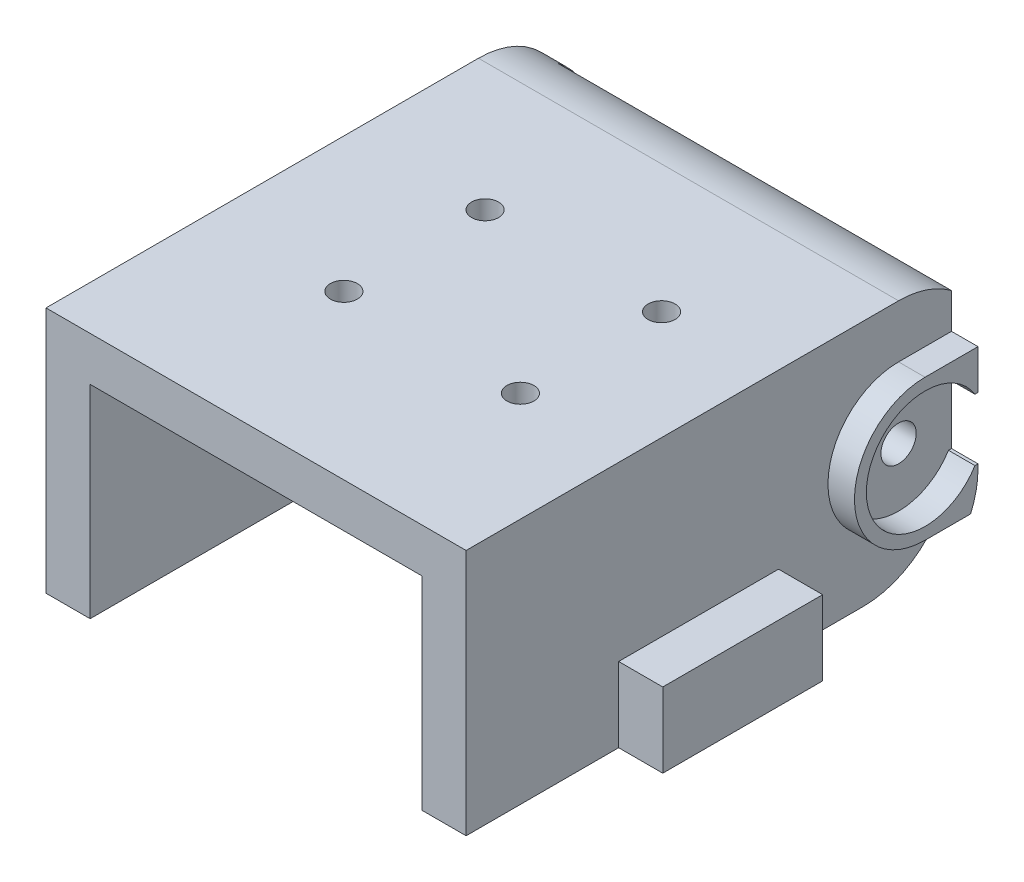
ISO-10303-21;
HEADER;
FILE_DESCRIPTION(('STEP AP214'),'2;1');
FILE_NAME('part.step','',(''),(''),'','','');
FILE_SCHEMA(('AUTOMOTIVE_DESIGN { 1 0 10303 214 1 1 1 1 }'));
ENDSEC;
DATA;
#1=APPLICATION_CONTEXT('core data for automotive mechanical design processes');
#2=APPLICATION_PROTOCOL_DEFINITION('international standard','automotive_design',2000,#1);
#3=PRODUCT_CONTEXT('',#1,'mechanical');
#4=PRODUCT('Part','Part','',(#3));
#5=PRODUCT_RELATED_PRODUCT_CATEGORY('part','',(#4));
#6=PRODUCT_DEFINITION_FORMATION('','',#4);
#7=PRODUCT_DEFINITION_CONTEXT('part definition',#1,'design');
#8=PRODUCT_DEFINITION('design','',#6,#7);
#9=PRODUCT_DEFINITION_SHAPE('','',#8);
#10=(LENGTH_UNIT() NAMED_UNIT(*) SI_UNIT(.MILLI.,.METRE.));
#11=(NAMED_UNIT(*) PLANE_ANGLE_UNIT() SI_UNIT($,.RADIAN.));
#12=(NAMED_UNIT(*) SI_UNIT($,.STERADIAN.) SOLID_ANGLE_UNIT());
#13=UNCERTAINTY_MEASURE_WITH_UNIT(LENGTH_MEASURE(1.E-05),#10,'distance_accuracy_value','');
#14=(GEOMETRIC_REPRESENTATION_CONTEXT(3) GLOBAL_UNCERTAINTY_ASSIGNED_CONTEXT((#13)) GLOBAL_UNIT_ASSIGNED_CONTEXT((#10,
#11,#12)) REPRESENTATION_CONTEXT('',''));
#15=CARTESIAN_POINT('',(0.,0.,0.));
#16=DIRECTION('',(0.,0.,1.));
#17=DIRECTION('',(1.,0.,0.));
#18=AXIS2_PLACEMENT_3D('',#15,#16,#17);
#19=CARTESIAN_POINT('',(0.,0.,0.));
#20=DIRECTION('',(0.,0.,1.));
#21=DIRECTION('',(1.,0.,0.));
#22=AXIS2_PLACEMENT_3D('',#19,#20,#21);
#23=PLANE('',#22);
#24=DIRECTION('',(0.,1.,0.));
#25=VECTOR('',#24,1.);
#26=CARTESIAN_POINT('',(26.8,0.,0.));
#27=LINE('',#26,#25);
#28=CARTESIAN_POINT('',(26.8,-4.,0.));
#29=VERTEX_POINT('',#28);
#30=CARTESIAN_POINT('',(26.8,-3.49999999999999,0.));
#31=VERTEX_POINT('',#30);
#32=EDGE_CURVE('E381',#29,#31,#27,.T.);
#33=ORIENTED_EDGE('',*,*,#32,.F.);
#34=DIRECTION('',(1.,0.,0.));
#35=VECTOR('',#34,1.);
#36=CARTESIAN_POINT('',(0.,-4.,0.));
#37=LINE('',#36,#35);
#38=CARTESIAN_POINT('',(-20.8,-4.,0.));
#39=VERTEX_POINT('',#38);
#40=EDGE_CURVE('E554',#29,#39,#37,.F.);
#41=ORIENTED_EDGE('',*,*,#40,.T.);
#42=DIRECTION('',(0.,-1.,0.));
#43=VECTOR('',#42,1.);
#44=CARTESIAN_POINT('',(-20.8,14.,0.));
#45=LINE('',#44,#43);
#46=CARTESIAN_POINT('',(-20.8,12.,0.));
#47=VERTEX_POINT('',#46);
#48=EDGE_CURVE('E316',#47,#39,#45,.T.);
#49=ORIENTED_EDGE('',*,*,#48,.F.);
#50=DIRECTION('',(1.,0.,0.));
#51=VECTOR('',#50,1.);
#52=CARTESIAN_POINT('',(-20.8,12.,0.));
#53=LINE('',#52,#51);
#54=CARTESIAN_POINT('',(23.8,12.,0.));
#55=VERTEX_POINT('',#54);
#56=EDGE_CURVE('E551',#47,#55,#53,.T.);
#57=ORIENTED_EDGE('',*,*,#56,.T.);
#58=DIRECTION('',(0.,1.,0.));
#59=VECTOR('',#58,1.);
#60=CARTESIAN_POINT('',(23.8,14.,0.));
#61=LINE('',#60,#59);
#62=CARTESIAN_POINT('',(23.8,8.00000000000001,0.));
#63=VERTEX_POINT('',#62);
#64=EDGE_CURVE('E500',#63,#55,#61,.T.);
#65=ORIENTED_EDGE('',*,*,#64,.F.);
#66=DIRECTION('',(-1.,0.,0.));
#67=VECTOR('',#66,1.);
#68=CARTESIAN_POINT('',(26.8,8.00000000000001,0.));
#69=LINE('',#68,#67);
#70=CARTESIAN_POINT('',(26.8,8.00000000000001,0.));
#71=VERTEX_POINT('',#70);
#72=EDGE_CURVE('E434',#71,#63,#69,.T.);
#73=ORIENTED_EDGE('',*,*,#72,.F.);
#74=DIRECTION('',(0.,1.,0.));
#75=VECTOR('',#74,1.);
#76=CARTESIAN_POINT('',(26.8,0.,0.));
#77=LINE('',#76,#75);
#78=CARTESIAN_POINT('',(26.8,3.50000000000001,0.));
#79=VERTEX_POINT('',#78);
#80=EDGE_CURVE('E396',#79,#71,#77,.T.);
#81=ORIENTED_EDGE('',*,*,#80,.F.);
#82=DIRECTION('',(-1.,0.,0.));
#83=VECTOR('',#82,1.);
#84=CARTESIAN_POINT('',(26.8,3.50000000000001,0.));
#85=LINE('',#84,#83);
#86=CARTESIAN_POINT('',(23.8,3.50000000000001,0.));
#87=VERTEX_POINT('',#86);
#88=EDGE_CURVE('E438',#79,#87,#85,.T.);
#89=ORIENTED_EDGE('',*,*,#88,.T.);
#90=CARTESIAN_POINT('',(23.8,-3.49999999999999,0.));
#91=VERTEX_POINT('',#90);
#92=EDGE_CURVE('E509',#91,#87,#61,.T.);
#93=ORIENTED_EDGE('',*,*,#92,.F.);
#94=DIRECTION('',(-1.,0.,0.));
#95=VECTOR('',#94,1.);
#96=CARTESIAN_POINT('',(26.8,-3.49999999999999,0.));
#97=LINE('',#96,#95);
#98=EDGE_CURVE('E450',#31,#91,#97,.T.);
#99=ORIENTED_EDGE('',*,*,#98,.F.);
#100=EDGE_LOOP('',(#33,#41,#49,#57,#65,#73,#81,#89,#93,#99));
#101=FACE_BOUND('',#100,.T.);
#102=ADVANCED_FACE('F47',(#101),#23,.F.);
#103=CARTESIAN_POINT('',(23.8,14.,55.));
#104=DIRECTION('',(-1.,0.,0.));
#105=DIRECTION('',(0.,-1.,0.));
#106=AXIS2_PLACEMENT_3D('',#103,#104,#105);
#107=PLANE('',#106);
#108=CARTESIAN_POINT('',(23.8,0.,6.));
#109=DIRECTION('',(1.,0.,0.));
#110=DIRECTION('',(0.,1.,0.));
#111=AXIS2_PLACEMENT_3D('',#108,#109,#110);
#112=CIRCLE('',#111,2.);
#113=CARTESIAN_POINT('',(23.8,2.00000000000001,6.));
#114=VERTEX_POINT('',#113);
#115=EDGE_CURVE('E495',#114,#114,#112,.T.);
#116=ORIENTED_EDGE('',*,*,#115,.F.);
#117=EDGE_LOOP('',(#116));
#118=FACE_BOUND('',#117,.T.);
#119=CARTESIAN_POINT('',(23.8,0.,6.));
#120=DIRECTION('',(1.,0.,0.));
#121=DIRECTION('',(0.,1.,0.));
#122=AXIS2_PLACEMENT_3D('',#119,#120,#121);
#123=CIRCLE('',#122,6.65);
#124=CARTESIAN_POINT('',(23.8,3.50000000000001,0.345576952508767));
#125=VERTEX_POINT('',#124);
#126=CARTESIAN_POINT('',(23.8,-3.49999999999999,0.34557695250877));
#127=VERTEX_POINT('',#126);
#128=EDGE_CURVE('E413',#125,#127,#123,.T.);
#129=ORIENTED_EDGE('',*,*,#128,.T.);
#130=DIRECTION('',(0.,0.,-1.));
#131=VECTOR('',#130,1.);
#132=CARTESIAN_POINT('',(23.8,-3.49999999999999,0.));
#133=LINE('',#132,#131);
#134=EDGE_CURVE('E410',#127,#91,#133,.T.);
#135=ORIENTED_EDGE('',*,*,#134,.T.);
#136=ORIENTED_EDGE('',*,*,#92,.T.);
#137=DIRECTION('',(0.,0.,-1.));
#138=VECTOR('',#137,1.);
#139=CARTESIAN_POINT('',(23.8,3.50000000000001,0.));
#140=LINE('',#139,#138);
#141=EDGE_CURVE('E416',#125,#87,#140,.T.);
#142=ORIENTED_EDGE('',*,*,#141,.F.);
#143=EDGE_LOOP('',(#129,#135,#136,#142));
#144=FACE_BOUND('',#143,.T.);
#145=ADVANCED_FACE('F702',(#118,#144),#107,.F.);
#146=DIRECTION('',(0.,0.,-1.));
#147=VECTOR('',#146,1.);
#148=CARTESIAN_POINT('',(23.8,-14.,55.));
#149=LINE('',#148,#147);
#150=CARTESIAN_POINT('',(23.8,-14.,19.6013578747392));
#151=VERTEX_POINT('',#150);
#152=CARTESIAN_POINT('',(23.8,-14.,10.));
#153=VERTEX_POINT('',#152);
#154=EDGE_CURVE('E519',#151,#153,#149,.T.);
#155=ORIENTED_EDGE('',*,*,#154,.T.);
#156=CARTESIAN_POINT('',(23.8,-4.,10.));
#157=DIRECTION('',(-1.,0.,0.));
#158=DIRECTION('',(0.,-1.,0.));
#159=AXIS2_PLACEMENT_3D('',#156,#157,#158);
#160=CIRCLE('',#159,10.);
#161=CARTESIAN_POINT('',(23.8,-7.99999999999999,0.834848610088319));
#162=VERTEX_POINT('',#161);
#163=EDGE_CURVE('E542',#153,#162,#160,.F.);
#164=ORIENTED_EDGE('',*,*,#163,.T.);
#165=DIRECTION('',(0.,0.,-1.));
#166=VECTOR('',#165,1.);
#167=CARTESIAN_POINT('',(23.8,-7.99999999999999,0.));
#168=LINE('',#167,#166);
#169=CARTESIAN_POINT('',(23.8,-7.99999999999999,6.));
#170=VERTEX_POINT('',#169);
#171=EDGE_CURVE('E376',#170,#162,#168,.T.);
#172=ORIENTED_EDGE('',*,*,#171,.F.);
#173=CARTESIAN_POINT('',(23.8,0.,6.));
#174=DIRECTION('',(1.,0.,0.));
#175=DIRECTION('',(0.,1.,0.));
#176=AXIS2_PLACEMENT_3D('',#173,#174,#175);
#177=CIRCLE('',#176,8.);
#178=CARTESIAN_POINT('',(23.8,8.00000000000001,6.));
#179=VERTEX_POINT('',#178);
#180=EDGE_CURVE('E382',#179,#170,#177,.T.);
#181=ORIENTED_EDGE('',*,*,#180,.F.);
#182=DIRECTION('',(0.,0.,-1.));
#183=VECTOR('',#182,1.);
#184=CARTESIAN_POINT('',(23.8,8.00000000000001,0.));
#185=LINE('',#184,#183);
#186=EDGE_CURVE('E420',#179,#63,#185,.T.);
#187=ORIENTED_EDGE('',*,*,#186,.T.);
#188=ORIENTED_EDGE('',*,*,#64,.T.);
#189=CARTESIAN_POINT('',(23.8,4.,6.));
#190=DIRECTION('',(-1.,0.,0.));
#191=DIRECTION('',(0.,-1.,0.));
#192=AXIS2_PLACEMENT_3D('',#189,#190,#191);
#193=CIRCLE('',#192,10.);
#194=CARTESIAN_POINT('',(23.8,14.,6.));
#195=VERTEX_POINT('',#194);
#196=EDGE_CURVE('E539',#55,#195,#193,.F.);
#197=ORIENTED_EDGE('',*,*,#196,.T.);
#198=DIRECTION('',(0.,0.,-1.));
#199=VECTOR('',#198,1.);
#200=CARTESIAN_POINT('',(23.8,14.,55.));
#201=LINE('',#200,#199);
#202=CARTESIAN_POINT('',(23.8,14.,55.));
#203=VERTEX_POINT('',#202);
#204=EDGE_CURVE('E357',#203,#195,#201,.T.);
#205=ORIENTED_EDGE('',*,*,#204,.F.);
#206=DIRECTION('',(0.,1.,0.));
#207=VECTOR('',#206,1.);
#208=CARTESIAN_POINT('',(23.8,14.,55.));
#209=LINE('',#208,#207);
#210=CARTESIAN_POINT('',(23.8,-14.,55.));
#211=VERTEX_POINT('',#210);
#212=EDGE_CURVE('E504',#211,#203,#209,.T.);
#213=ORIENTED_EDGE('',*,*,#212,.F.);
#214=CARTESIAN_POINT('',(23.8,-14.,37.7174277893702));
#215=VERTEX_POINT('',#214);
#216=EDGE_CURVE('E523',#211,#215,#149,.T.);
#217=ORIENTED_EDGE('',*,*,#216,.T.);
#218=DIRECTION('',(0.,-1.,0.));
#219=VECTOR('',#218,1.);
#220=CARTESIAN_POINT('',(23.8,-14.,37.7174277893702));
#221=LINE('',#220,#219);
#222=CARTESIAN_POINT('',(23.8,-5.53669618417802,37.7174277893702));
#223=VERTEX_POINT('',#222);
#224=EDGE_CURVE('E454',#223,#215,#221,.T.);
#225=ORIENTED_EDGE('',*,*,#224,.F.);
#226=DIRECTION('',(0.,0.,1.));
#227=VECTOR('',#226,1.);
#228=CARTESIAN_POINT('',(23.8,-5.53669618417802,37.7174277893702));
#229=LINE('',#228,#227);
#230=CARTESIAN_POINT('',(23.8,-5.53669618417802,19.6013578747392));
#231=VERTEX_POINT('',#230);
#232=EDGE_CURVE('E460',#231,#223,#229,.T.);
#233=ORIENTED_EDGE('',*,*,#232,.F.);
#234=DIRECTION('',(0.,1.,0.));
#235=VECTOR('',#234,1.);
#236=CARTESIAN_POINT('',(23.8,-14.,19.6013578747392));
#237=LINE('',#236,#235);
#238=EDGE_CURVE('E473',#151,#231,#237,.T.);
#239=ORIENTED_EDGE('',*,*,#238,.F.);
#240=EDGE_LOOP('',(#155,#164,#172,#181,#187,#188,#197,#205,#213,#217,#225,#233,#239));
#241=FACE_BOUND('',#240,.T.);
#242=ADVANCED_FACE('F616',(#241),#107,.F.);
#243=CARTESIAN_POINT('',(-23.8,14.,55.));
#244=DIRECTION('',(0.,-1.,0.));
#245=DIRECTION('',(0.,0.,-1.));
#246=AXIS2_PLACEMENT_3D('',#243,#244,#245);
#247=PLANE('',#246);
#248=CARTESIAN_POINT('',(-8.54999999999984,14.,36.5));
#249=DIRECTION('',(0.,1.,0.));
#250=DIRECTION('',(0.,0.,1.));
#251=AXIS2_PLACEMENT_3D('',#248,#249,#250);
#252=CIRCLE('',#251,1.53015016707913);
#253=CARTESIAN_POINT('',(-8.54999999999984,14.,38.0301501670791));
#254=VERTEX_POINT('',#253);
#255=EDGE_CURVE('E300',#254,#254,#252,.T.);
#256=ORIENTED_EDGE('',*,*,#255,.F.);
#257=EDGE_LOOP('',(#256));
#258=FACE_BOUND('',#257,.T.);
#259=CARTESIAN_POINT('',(11.4500000000002,14.,36.5));
#260=DIRECTION('',(0.,1.,0.));
#261=DIRECTION('',(0.,0.,1.));
#262=AXIS2_PLACEMENT_3D('',#259,#260,#261);
#263=CIRCLE('',#262,1.53015016707913);
#264=CARTESIAN_POINT('',(11.4500000000002,14.,38.0301501670791));
#265=VERTEX_POINT('',#264);
#266=EDGE_CURVE('E306',#265,#265,#263,.T.);
#267=ORIENTED_EDGE('',*,*,#266,.F.);
#268=EDGE_LOOP('',(#267));
#269=FACE_BOUND('',#268,.T.);
#270=CARTESIAN_POINT('',(11.45,14.,20.5));
#271=DIRECTION('',(0.,1.,0.));
#272=DIRECTION('',(0.,0.,1.));
#273=AXIS2_PLACEMENT_3D('',#270,#271,#272);
#274=CIRCLE('',#273,1.53015016707913);
#275=CARTESIAN_POINT('',(11.45,14.,22.0301501670791));
#276=VERTEX_POINT('',#275);
#277=EDGE_CURVE('E301',#276,#276,#274,.T.);
#278=ORIENTED_EDGE('',*,*,#277,.F.);
#279=EDGE_LOOP('',(#278));
#280=FACE_BOUND('',#279,.T.);
#281=CARTESIAN_POINT('',(-8.55,14.,20.5));
#282=DIRECTION('',(0.,1.,0.));
#283=DIRECTION('',(0.,0.,1.));
#284=AXIS2_PLACEMENT_3D('',#281,#282,#283);
#285=CIRCLE('',#284,1.53015016707913);
#286=CARTESIAN_POINT('',(-8.55,14.,22.0301501670791));
#287=VERTEX_POINT('',#286);
#288=EDGE_CURVE('E305',#287,#287,#285,.T.);
#289=ORIENTED_EDGE('',*,*,#288,.F.);
#290=EDGE_LOOP('',(#289));
#291=FACE_BOUND('',#290,.T.);
#292=ORIENTED_EDGE('',*,*,#204,.T.);
#293=DIRECTION('',(1.,0.,0.));
#294=VECTOR('',#293,1.);
#295=CARTESIAN_POINT('',(-23.8,14.,6.));
#296=LINE('',#295,#294);
#297=CARTESIAN_POINT('',(-23.8,14.,6.));
#298=VERTEX_POINT('',#297);
#299=EDGE_CURVE('E564',#195,#298,#296,.F.);
#300=ORIENTED_EDGE('',*,*,#299,.T.);
#301=DIRECTION('',(0.,0.,-1.));
#302=VECTOR('',#301,1.);
#303=CARTESIAN_POINT('',(-23.8,14.,55.));
#304=LINE('',#303,#302);
#305=CARTESIAN_POINT('',(-23.8,14.,55.));
#306=VERTEX_POINT('',#305);
#307=EDGE_CURVE('E529',#306,#298,#304,.T.);
#308=ORIENTED_EDGE('',*,*,#307,.F.);
#309=DIRECTION('',(-1.,0.,0.));
#310=VECTOR('',#309,1.);
#311=CARTESIAN_POINT('',(-23.8,14.,55.));
#312=LINE('',#311,#310);
#313=EDGE_CURVE('E508',#203,#306,#312,.T.);
#314=ORIENTED_EDGE('',*,*,#313,.F.);
#315=EDGE_LOOP('',(#292,#300,#308,#314));
#316=FACE_BOUND('',#315,.T.);
#317=ADVANCED_FACE('F612',(#258,#269,#280,#291,#316),#247,.F.);
#318=CARTESIAN_POINT('',(-23.8,14.,55.));
#319=DIRECTION('',(1.,0.,0.));
#320=DIRECTION('',(0.,1.,0.));
#321=AXIS2_PLACEMENT_3D('',#318,#319,#320);
#322=PLANE('',#321);
#323=DIRECTION('',(0.,1.,0.));
#324=VECTOR('',#323,1.);
#325=CARTESIAN_POINT('',(-23.8,14.,-4.));
#326=LINE('',#325,#324);
#327=CARTESIAN_POINT('',(-23.8,-4.,-4.));
#328=VERTEX_POINT('',#327);
#329=CARTESIAN_POINT('',(-23.8,4.,-4.));
#330=VERTEX_POINT('',#329);
#331=EDGE_CURVE('E317',#328,#330,#326,.T.);
#332=ORIENTED_EDGE('',*,*,#331,.F.);
#333=CARTESIAN_POINT('',(-23.8,-4.,6.));
#334=DIRECTION('',(1.,0.,0.));
#335=DIRECTION('',(0.,1.,0.));
#336=AXIS2_PLACEMENT_3D('',#333,#334,#335);
#337=CIRCLE('',#336,10.);
#338=CARTESIAN_POINT('',(-23.8,-14.,6.));
#339=VERTEX_POINT('',#338);
#340=EDGE_CURVE('E579',#328,#339,#337,.F.);
#341=ORIENTED_EDGE('',*,*,#340,.T.);
#342=DIRECTION('',(0.,0.,-1.));
#343=VECTOR('',#342,1.);
#344=CARTESIAN_POINT('',(-23.8,-14.,55.));
#345=LINE('',#344,#343);
#346=CARTESIAN_POINT('',(-23.8,-14.,55.));
#347=VERTEX_POINT('',#346);
#348=EDGE_CURVE('E526',#347,#339,#345,.T.);
#349=ORIENTED_EDGE('',*,*,#348,.F.);
#350=DIRECTION('',(0.,-1.,0.));
#351=VECTOR('',#350,1.);
#352=CARTESIAN_POINT('',(-23.8,14.,55.));
#353=LINE('',#352,#351);
#354=EDGE_CURVE('E512',#306,#347,#353,.T.);
#355=ORIENTED_EDGE('',*,*,#354,.F.);
#356=ORIENTED_EDGE('',*,*,#307,.T.);
#357=CARTESIAN_POINT('',(-23.8,4.,6.));
#358=DIRECTION('',(1.,0.,0.));
#359=DIRECTION('',(0.,1.,0.));
#360=AXIS2_PLACEMENT_3D('',#357,#358,#359);
#361=CIRCLE('',#360,10.);
#362=EDGE_CURVE('E567',#298,#330,#361,.F.);
#363=ORIENTED_EDGE('',*,*,#362,.T.);
#364=EDGE_LOOP('',(#332,#341,#349,#355,#356,#363));
#365=FACE_BOUND('',#364,.T.);
#366=CARTESIAN_POINT('',(-23.8,0.,6.));
#367=DIRECTION('',(-1.,0.,0.));
#368=DIRECTION('',(0.,-1.,0.));
#369=AXIS2_PLACEMENT_3D('',#366,#367,#368);
#370=CIRCLE('',#369,10.);
#371=CARTESIAN_POINT('',(-23.8,-3.5,-3.36749699759759));
#372=VERTEX_POINT('',#371);
#373=CARTESIAN_POINT('',(-23.8,3.5,-3.36749699759759));
#374=VERTEX_POINT('',#373);
#375=EDGE_CURVE('E351',#372,#374,#370,.T.);
#376=ORIENTED_EDGE('',*,*,#375,.F.);
#377=DIRECTION('',(0.,0.,-1.));
#378=VECTOR('',#377,1.);
#379=CARTESIAN_POINT('',(-23.8,-3.5,0.));
#380=LINE('',#379,#378);
#381=CARTESIAN_POINT('',(-23.8,-3.5,-1.19374728496908));
#382=VERTEX_POINT('',#381);
#383=EDGE_CURVE('E330',#382,#372,#380,.T.);
#384=ORIENTED_EDGE('',*,*,#383,.F.);
#385=CARTESIAN_POINT('',(-23.8,0.,6.));
#386=DIRECTION('',(-1.,0.,0.));
#387=DIRECTION('',(0.,-1.,0.));
#388=AXIS2_PLACEMENT_3D('',#385,#386,#387);
#389=CIRCLE('',#388,8.);
#390=CARTESIAN_POINT('',(-23.8,3.5,-1.19374728496908));
#391=VERTEX_POINT('',#390);
#392=EDGE_CURVE('E347',#382,#391,#389,.T.);
#393=ORIENTED_EDGE('',*,*,#392,.T.);
#394=DIRECTION('',(0.,0.,-1.));
#395=VECTOR('',#394,1.);
#396=CARTESIAN_POINT('',(-23.8,3.5,0.));
#397=LINE('',#396,#395);
#398=EDGE_CURVE('E336',#391,#374,#397,.T.);
#399=ORIENTED_EDGE('',*,*,#398,.T.);
#400=EDGE_LOOP('',(#376,#384,#393,#399));
#401=FACE_BOUND('',#400,.T.);
#402=ADVANCED_FACE('F615',(#365,#401),#322,.F.);
#403=CARTESIAN_POINT('',(-23.8,-14.,55.));
#404=DIRECTION('',(0.,1.,0.));
#405=DIRECTION('',(0.,0.,1.));
#406=AXIS2_PLACEMENT_3D('',#403,#404,#405);
#407=PLANE('',#406);
#408=DIRECTION('',(1.,0.,0.));
#409=VECTOR('',#408,1.);
#410=CARTESIAN_POINT('',(-18.8,-14.,15.));
#411=LINE('',#410,#409);
#412=CARTESIAN_POINT('',(-18.8,-14.,15.));
#413=VERTEX_POINT('',#412);
#414=CARTESIAN_POINT('',(18.8,-14.,15.));
#415=VERTEX_POINT('',#414);
#416=EDGE_CURVE('E257',#413,#415,#411,.T.);
#417=ORIENTED_EDGE('',*,*,#416,.F.);
#418=DIRECTION('',(0.,0.,1.));
#419=VECTOR('',#418,1.);
#420=CARTESIAN_POINT('',(-18.8,-14.,15.));
#421=LINE('',#420,#419);
#422=CARTESIAN_POINT('',(-18.8,-14.,55.));
#423=VERTEX_POINT('',#422);
#424=EDGE_CURVE('E240',#413,#423,#421,.T.);
#425=ORIENTED_EDGE('',*,*,#424,.T.);
#426=DIRECTION('',(1.,0.,0.));
#427=VECTOR('',#426,1.);
#428=CARTESIAN_POINT('',(-23.8,-14.,55.));
#429=LINE('',#428,#427);
#430=EDGE_CURVE('E516',#347,#423,#429,.T.);
#431=ORIENTED_EDGE('',*,*,#430,.F.);
#432=ORIENTED_EDGE('',*,*,#348,.T.);
#433=DIRECTION('',(-1.,0.,0.));
#434=VECTOR('',#433,1.);
#435=CARTESIAN_POINT('',(-23.8,-14.,6.));
#436=LINE('',#435,#434);
#437=CARTESIAN_POINT('',(-20.8,-14.,6.));
#438=VERTEX_POINT('',#437);
#439=EDGE_CURVE('E57',#339,#438,#436,.F.);
#440=ORIENTED_EDGE('',*,*,#439,.T.);
#441=DIRECTION('',(0.,0.,1.));
#442=VECTOR('',#441,1.);
#443=CARTESIAN_POINT('',(-20.8,-14.,-4.));
#444=LINE('',#443,#442);
#445=CARTESIAN_POINT('',(-20.8,-14.,10.));
#446=VERTEX_POINT('',#445);
#447=EDGE_CURVE('E324',#438,#446,#444,.T.);
#448=ORIENTED_EDGE('',*,*,#447,.T.);
#449=DIRECTION('',(1.,0.,0.));
#450=VECTOR('',#449,1.);
#451=CARTESIAN_POINT('',(-23.8,-14.,10.));
#452=LINE('',#451,#450);
#453=EDGE_CURVE('E350',#446,#153,#452,.T.);
#454=ORIENTED_EDGE('',*,*,#453,.T.);
#455=ORIENTED_EDGE('',*,*,#154,.F.);
#456=DIRECTION('',(-1.,0.,0.));
#457=VECTOR('',#456,1.);
#458=CARTESIAN_POINT('',(28.8,-14.,19.6013578747392));
#459=LINE('',#458,#457);
#460=CARTESIAN_POINT('',(28.8,-14.,19.6013578747392));
#461=VERTEX_POINT('',#460);
#462=EDGE_CURVE('E487',#461,#151,#459,.T.);
#463=ORIENTED_EDGE('',*,*,#462,.F.);
#464=DIRECTION('',(0.,0.,-1.));
#465=VECTOR('',#464,1.);
#466=CARTESIAN_POINT('',(28.8,-14.,37.7174277893702));
#467=LINE('',#466,#465);
#468=CARTESIAN_POINT('',(28.8,-14.,37.7174277893702));
#469=VERTEX_POINT('',#468);
#470=EDGE_CURVE('E459',#469,#461,#467,.T.);
#471=ORIENTED_EDGE('',*,*,#470,.F.);
#472=DIRECTION('',(-1.,0.,0.));
#473=VECTOR('',#472,1.);
#474=CARTESIAN_POINT('',(28.8,-14.,37.7174277893702));
#475=LINE('',#474,#473);
#476=EDGE_CURVE('E491',#469,#215,#475,.T.);
#477=ORIENTED_EDGE('',*,*,#476,.T.);
#478=ORIENTED_EDGE('',*,*,#216,.F.);
#479=CARTESIAN_POINT('',(18.8,-14.,55.));
#480=VERTEX_POINT('',#479);
#481=EDGE_CURVE('E515',#480,#211,#429,.T.);
#482=ORIENTED_EDGE('',*,*,#481,.F.);
#483=DIRECTION('',(0.,0.,1.));
#484=VECTOR('',#483,1.);
#485=CARTESIAN_POINT('',(18.8,-14.,15.));
#486=LINE('',#485,#484);
#487=EDGE_CURVE('E64',#415,#480,#486,.T.);
#488=ORIENTED_EDGE('',*,*,#487,.F.);
#489=EDGE_LOOP('',(#417,#425,#431,#432,#440,#448,#454,#455,#463,#471,#477,#478,#482,#488));
#490=FACE_BOUND('',#489,.T.);
#491=ADVANCED_FACE('F262',(#490),#407,.F.);
#492=CARTESIAN_POINT('',(0.,0.,55.));
#493=DIRECTION('',(0.,0.,1.));
#494=DIRECTION('',(1.,0.,0.));
#495=AXIS2_PLACEMENT_3D('',#492,#493,#494);
#496=PLANE('',#495);
#497=DIRECTION('',(0.,-1.,0.));
#498=VECTOR('',#497,1.);
#499=CARTESIAN_POINT('',(-18.8,-14.,55.));
#500=LINE('',#499,#498);
#501=CARTESIAN_POINT('',(-18.8,9.,55.));
#502=VERTEX_POINT('',#501);
#503=EDGE_CURVE('E246',#502,#423,#500,.T.);
#504=ORIENTED_EDGE('',*,*,#503,.F.);
#505=DIRECTION('',(-1.,0.,0.));
#506=VECTOR('',#505,1.);
#507=CARTESIAN_POINT('',(-18.8,9.,55.));
#508=LINE('',#507,#506);
#509=CARTESIAN_POINT('',(18.8,9.,55.));
#510=VERTEX_POINT('',#509);
#511=EDGE_CURVE('E260',#510,#502,#508,.T.);
#512=ORIENTED_EDGE('',*,*,#511,.F.);
#513=DIRECTION('',(0.,1.,0.));
#514=VECTOR('',#513,1.);
#515=CARTESIAN_POINT('',(18.8,-14.,55.));
#516=LINE('',#515,#514);
#517=EDGE_CURVE('E274',#480,#510,#516,.T.);
#518=ORIENTED_EDGE('',*,*,#517,.F.);
#519=ORIENTED_EDGE('',*,*,#481,.T.);
#520=ORIENTED_EDGE('',*,*,#212,.T.);
#521=ORIENTED_EDGE('',*,*,#313,.T.);
#522=ORIENTED_EDGE('',*,*,#354,.T.);
#523=ORIENTED_EDGE('',*,*,#430,.T.);
#524=EDGE_LOOP('',(#504,#512,#518,#519,#520,#521,#522,#523));
#525=FACE_BOUND('',#524,.T.);
#526=ADVANCED_FACE('F636',(#525),#496,.T.);
#527=CARTESIAN_POINT('',(20.8,0.,6.));
#528=DIRECTION('',(1.,0.,0.));
#529=DIRECTION('',(0.,1.,0.));
#530=AXIS2_PLACEMENT_3D('',#527,#528,#529);
#531=CYLINDRICAL_SURFACE('',#530,2.);
#532=CARTESIAN_POINT('',(20.8,0.,6.));
#533=DIRECTION('',(1.,0.,0.));
#534=DIRECTION('',(0.,1.,0.));
#535=AXIS2_PLACEMENT_3D('',#532,#533,#534);
#536=CIRCLE('',#535,2.);
#537=CARTESIAN_POINT('',(20.8,2.00000000000001,6.));
#538=VERTEX_POINT('',#537);
#539=EDGE_CURVE('E496',#538,#538,#536,.T.);
#540=ORIENTED_EDGE('',*,*,#539,.F.);
#541=EDGE_LOOP('',(#540));
#542=FACE_BOUND('',#541,.T.);
#543=ORIENTED_EDGE('',*,*,#115,.T.);
#544=EDGE_LOOP('',(#543));
#545=FACE_BOUND('',#544,.T.);
#546=ADVANCED_FACE('F932',(#542,#545),#531,.F.);
#547=CARTESIAN_POINT('',(20.8,0.,6.));
#548=DIRECTION('',(1.,0.,0.));
#549=DIRECTION('',(0.,1.,0.));
#550=AXIS2_PLACEMENT_3D('',#547,#548,#549);
#551=PLANE('',#550);
#552=ORIENTED_EDGE('',*,*,#539,.T.);
#553=EDGE_LOOP('',(#552));
#554=FACE_BOUND('',#553,.T.);
#555=ADVANCED_FACE('F946',(#554),#551,.T.);
#556=CARTESIAN_POINT('',(28.8,-14.,37.7174277893702));
#557=DIRECTION('',(0.,0.,-1.));
#558=DIRECTION('',(-1.,0.,0.));
#559=AXIS2_PLACEMENT_3D('',#556,#557,#558);
#560=PLANE('',#559);
#561=ORIENTED_EDGE('',*,*,#224,.T.);
#562=ORIENTED_EDGE('',*,*,#476,.F.);
#563=DIRECTION('',(0.,-1.,0.));
#564=VECTOR('',#563,1.);
#565=CARTESIAN_POINT('',(28.8,-14.,37.7174277893702));
#566=LINE('',#565,#564);
#567=CARTESIAN_POINT('',(28.8,-5.53669618417802,37.7174277893702));
#568=VERTEX_POINT('',#567);
#569=EDGE_CURVE('E455',#568,#469,#566,.T.);
#570=ORIENTED_EDGE('',*,*,#569,.F.);
#571=DIRECTION('',(-1.,0.,0.));
#572=VECTOR('',#571,1.);
#573=CARTESIAN_POINT('',(28.8,-5.53669618417802,37.7174277893702));
#574=LINE('',#573,#572);
#575=EDGE_CURVE('E469',#568,#223,#574,.T.);
#576=ORIENTED_EDGE('',*,*,#575,.T.);
#577=EDGE_LOOP('',(#561,#562,#570,#576));
#578=FACE_BOUND('',#577,.T.);
#579=ADVANCED_FACE('F642',(#578),#560,.F.);
#580=CARTESIAN_POINT('',(28.8,-14.,19.6013578747392));
#581=DIRECTION('',(0.,0.,1.));
#582=DIRECTION('',(1.,0.,0.));
#583=AXIS2_PLACEMENT_3D('',#580,#581,#582);
#584=PLANE('',#583);
#585=ORIENTED_EDGE('',*,*,#238,.T.);
#586=DIRECTION('',(-1.,0.,0.));
#587=VECTOR('',#586,1.);
#588=CARTESIAN_POINT('',(28.8,-5.53669618417802,19.6013578747392));
#589=LINE('',#588,#587);
#590=CARTESIAN_POINT('',(28.8,-5.53669618417802,19.6013578747392));
#591=VERTEX_POINT('',#590);
#592=EDGE_CURVE('E483',#591,#231,#589,.T.);
#593=ORIENTED_EDGE('',*,*,#592,.F.);
#594=DIRECTION('',(0.,1.,0.));
#595=VECTOR('',#594,1.);
#596=CARTESIAN_POINT('',(28.8,-14.,19.6013578747392));
#597=LINE('',#596,#595);
#598=EDGE_CURVE('E463',#461,#591,#597,.T.);
#599=ORIENTED_EDGE('',*,*,#598,.F.);
#600=ORIENTED_EDGE('',*,*,#462,.T.);
#601=EDGE_LOOP('',(#585,#593,#599,#600));
#602=FACE_BOUND('',#601,.T.);
#603=ADVANCED_FACE('F650',(#602),#584,.F.);
#604=CARTESIAN_POINT('',(28.8,-5.53669618417802,37.7174277893702));
#605=DIRECTION('',(0.,-1.,0.));
#606=DIRECTION('',(1.,0.,0.));
#607=AXIS2_PLACEMENT_3D('',#604,#605,#606);
#608=PLANE('',#607);
#609=ORIENTED_EDGE('',*,*,#232,.T.);
#610=ORIENTED_EDGE('',*,*,#575,.F.);
#611=DIRECTION('',(0.,0.,1.));
#612=VECTOR('',#611,1.);
#613=CARTESIAN_POINT('',(28.8,-5.53669618417802,37.7174277893702));
#614=LINE('',#613,#612);
#615=EDGE_CURVE('E466',#591,#568,#614,.T.);
#616=ORIENTED_EDGE('',*,*,#615,.F.);
#617=ORIENTED_EDGE('',*,*,#592,.T.);
#618=EDGE_LOOP('',(#609,#610,#616,#617));
#619=FACE_BOUND('',#618,.T.);
#620=ADVANCED_FACE('F646',(#619),#608,.F.);
#621=CARTESIAN_POINT('',(28.8,0.,0.));
#622=DIRECTION('',(-1.,0.,0.));
#623=DIRECTION('',(0.,-1.,0.));
#624=AXIS2_PLACEMENT_3D('',#621,#622,#623);
#625=PLANE('',#624);
#626=ORIENTED_EDGE('',*,*,#569,.T.);
#627=ORIENTED_EDGE('',*,*,#470,.T.);
#628=ORIENTED_EDGE('',*,*,#598,.T.);
#629=ORIENTED_EDGE('',*,*,#615,.T.);
#630=EDGE_LOOP('',(#626,#627,#628,#629));
#631=FACE_BOUND('',#630,.T.);
#632=ADVANCED_FACE('F982',(#631),#625,.F.);
#633=CARTESIAN_POINT('',(26.8,-7.99999999999999,0.));
#634=DIRECTION('',(0.,1.,0.));
#635=DIRECTION('',(-1.,0.,0.));
#636=AXIS2_PLACEMENT_3D('',#633,#634,#635);
#637=PLANE('',#636);
#638=ORIENTED_EDGE('',*,*,#171,.T.);
#639=DIRECTION('',(1.,0.,0.));
#640=VECTOR('',#639,1.);
#641=CARTESIAN_POINT('',(23.8,-7.99999999999999,0.834848610088319));
#642=LINE('',#641,#640);
#643=CARTESIAN_POINT('',(26.8,-7.99999999999999,0.834848610088319));
#644=VERTEX_POINT('',#643);
#645=EDGE_CURVE('E545',#162,#644,#642,.T.);
#646=ORIENTED_EDGE('',*,*,#645,.T.);
#647=DIRECTION('',(0.,0.,-1.));
#648=VECTOR('',#647,1.);
#649=CARTESIAN_POINT('',(26.8,-7.99999999999999,0.));
#650=LINE('',#649,#648);
#651=CARTESIAN_POINT('',(26.8,-7.99999999999999,6.));
#652=VERTEX_POINT('',#651);
#653=EDGE_CURVE('E377',#652,#644,#650,.T.);
#654=ORIENTED_EDGE('',*,*,#653,.F.);
#655=DIRECTION('',(-1.,0.,0.));
#656=VECTOR('',#655,1.);
#657=CARTESIAN_POINT('',(26.8,-7.99999999999999,6.));
#658=LINE('',#657,#656);
#659=EDGE_CURVE('E406',#652,#170,#658,.T.);
#660=ORIENTED_EDGE('',*,*,#659,.T.);
#661=EDGE_LOOP('',(#638,#646,#654,#660));
#662=FACE_BOUND('',#661,.T.);
#663=ADVANCED_FACE('F656',(#662),#637,.F.);
#664=CARTESIAN_POINT('',(26.8,-3.49999999999999,0.));
#665=DIRECTION('',(0.,1.,0.));
#666=DIRECTION('',(-1.,0.,0.));
#667=AXIS2_PLACEMENT_3D('',#664,#665,#666);
#668=PLANE('',#667);
#669=ORIENTED_EDGE('',*,*,#134,.F.);
#670=DIRECTION('',(-1.,0.,0.));
#671=VECTOR('',#670,1.);
#672=CARTESIAN_POINT('',(26.8,-3.49999999999999,0.34557695250877));
#673=LINE('',#672,#671);
#674=CARTESIAN_POINT('',(26.8,-3.49999999999999,0.34557695250877));
#675=VERTEX_POINT('',#674);
#676=EDGE_CURVE('E446',#675,#127,#673,.T.);
#677=ORIENTED_EDGE('',*,*,#676,.F.);
#678=DIRECTION('',(0.,0.,-1.));
#679=VECTOR('',#678,1.);
#680=CARTESIAN_POINT('',(26.8,-3.49999999999999,0.));
#681=LINE('',#680,#679);
#682=EDGE_CURVE('E385',#675,#31,#681,.T.);
#683=ORIENTED_EDGE('',*,*,#682,.T.);
#684=ORIENTED_EDGE('',*,*,#98,.T.);
#685=EDGE_LOOP('',(#669,#677,#683,#684));
#686=FACE_BOUND('',#685,.T.);
#687=ADVANCED_FACE('F673',(#686),#668,.T.);
#688=CARTESIAN_POINT('',(26.8,0.,6.));
#689=DIRECTION('',(-1.,0.,0.));
#690=DIRECTION('',(0.,-1.,0.));
#691=AXIS2_PLACEMENT_3D('',#688,#689,#690);
#692=CYLINDRICAL_SURFACE('',#691,6.65);
#693=ORIENTED_EDGE('',*,*,#128,.F.);
#694=DIRECTION('',(-1.,0.,0.));
#695=VECTOR('',#694,1.);
#696=CARTESIAN_POINT('',(26.8,3.50000000000001,0.34557695250877));
#697=LINE('',#696,#695);
#698=CARTESIAN_POINT('',(26.8,3.50000000000001,0.34557695250877));
#699=VERTEX_POINT('',#698);
#700=EDGE_CURVE('E442',#699,#125,#697,.T.);
#701=ORIENTED_EDGE('',*,*,#700,.F.);
#702=CARTESIAN_POINT('',(26.8,0.,6.));
#703=DIRECTION('',(1.,0.,0.));
#704=DIRECTION('',(0.,1.,0.));
#705=AXIS2_PLACEMENT_3D('',#702,#703,#704);
#706=CIRCLE('',#705,6.65);
#707=EDGE_CURVE('E389',#699,#675,#706,.T.);
#708=ORIENTED_EDGE('',*,*,#707,.T.);
#709=ORIENTED_EDGE('',*,*,#676,.T.);
#710=EDGE_LOOP('',(#693,#701,#708,#709));
#711=FACE_BOUND('',#710,.T.);
#712=ADVANCED_FACE('F677',(#711),#692,.F.);
#713=CARTESIAN_POINT('',(26.8,3.50000000000001,0.));
#714=DIRECTION('',(0.,1.,0.));
#715=DIRECTION('',(-1.,0.,0.));
#716=AXIS2_PLACEMENT_3D('',#713,#714,#715);
#717=PLANE('',#716);
#718=ORIENTED_EDGE('',*,*,#141,.T.);
#719=ORIENTED_EDGE('',*,*,#88,.F.);
#720=DIRECTION('',(0.,0.,-1.));
#721=VECTOR('',#720,1.);
#722=CARTESIAN_POINT('',(26.8,3.50000000000001,0.));
#723=LINE('',#722,#721);
#724=EDGE_CURVE('E393',#699,#79,#723,.T.);
#725=ORIENTED_EDGE('',*,*,#724,.F.);
#726=ORIENTED_EDGE('',*,*,#700,.T.);
#727=EDGE_LOOP('',(#718,#719,#725,#726));
#728=FACE_BOUND('',#727,.T.);
#729=ADVANCED_FACE('F681',(#728),#717,.F.);
#730=CARTESIAN_POINT('',(26.8,8.00000000000001,0.));
#731=DIRECTION('',(0.,1.,0.));
#732=DIRECTION('',(-1.,0.,0.));
#733=AXIS2_PLACEMENT_3D('',#730,#731,#732);
#734=PLANE('',#733);
#735=ORIENTED_EDGE('',*,*,#186,.F.);
#736=DIRECTION('',(-1.,0.,0.));
#737=VECTOR('',#736,1.);
#738=CARTESIAN_POINT('',(26.8,8.00000000000001,6.));
#739=LINE('',#738,#737);
#740=CARTESIAN_POINT('',(26.8,8.00000000000001,6.));
#741=VERTEX_POINT('',#740);
#742=EDGE_CURVE('E430',#741,#179,#739,.T.);
#743=ORIENTED_EDGE('',*,*,#742,.F.);
#744=DIRECTION('',(0.,0.,-1.));
#745=VECTOR('',#744,1.);
#746=CARTESIAN_POINT('',(26.8,8.00000000000001,0.));
#747=LINE('',#746,#745);
#748=EDGE_CURVE('E399',#741,#71,#747,.T.);
#749=ORIENTED_EDGE('',*,*,#748,.T.);
#750=ORIENTED_EDGE('',*,*,#72,.T.);
#751=EDGE_LOOP('',(#735,#743,#749,#750));
#752=FACE_BOUND('',#751,.T.);
#753=ADVANCED_FACE('F687',(#752),#734,.T.);
#754=CARTESIAN_POINT('',(26.8,0.,6.));
#755=DIRECTION('',(-1.,0.,0.));
#756=DIRECTION('',(0.,-1.,0.));
#757=AXIS2_PLACEMENT_3D('',#754,#755,#756);
#758=CYLINDRICAL_SURFACE('',#757,8.);
#759=ORIENTED_EDGE('',*,*,#180,.T.);
#760=ORIENTED_EDGE('',*,*,#659,.F.);
#761=CARTESIAN_POINT('',(26.8,0.,6.));
#762=DIRECTION('',(1.,0.,0.));
#763=DIRECTION('',(0.,1.,0.));
#764=AXIS2_PLACEMENT_3D('',#761,#762,#763);
#765=CIRCLE('',#764,8.);
#766=EDGE_CURVE('E403',#741,#652,#765,.T.);
#767=ORIENTED_EDGE('',*,*,#766,.F.);
#768=ORIENTED_EDGE('',*,*,#742,.T.);
#769=EDGE_LOOP('',(#759,#760,#767,#768));
#770=FACE_BOUND('',#769,.T.);
#771=ADVANCED_FACE('F690',(#770),#758,.T.);
#772=CARTESIAN_POINT('',(26.8,0.,0.));
#773=DIRECTION('',(1.,0.,0.));
#774=DIRECTION('',(0.,1.,0.));
#775=AXIS2_PLACEMENT_3D('',#772,#773,#774);
#776=PLANE('',#775);
#777=ORIENTED_EDGE('',*,*,#653,.T.);
#778=CARTESIAN_POINT('',(26.8,-4.,10.));
#779=DIRECTION('',(1.,0.,0.));
#780=DIRECTION('',(0.,1.,0.));
#781=AXIS2_PLACEMENT_3D('',#778,#779,#780);
#782=CIRCLE('',#781,10.);
#783=EDGE_CURVE('E548',#644,#29,#782,.T.);
#784=ORIENTED_EDGE('',*,*,#783,.T.);
#785=ORIENTED_EDGE('',*,*,#32,.T.);
#786=ORIENTED_EDGE('',*,*,#682,.F.);
#787=ORIENTED_EDGE('',*,*,#707,.F.);
#788=ORIENTED_EDGE('',*,*,#724,.T.);
#789=ORIENTED_EDGE('',*,*,#80,.T.);
#790=ORIENTED_EDGE('',*,*,#748,.F.);
#791=ORIENTED_EDGE('',*,*,#766,.T.);
#792=EDGE_LOOP('',(#777,#784,#785,#786,#787,#788,#789,#790,#791));
#793=FACE_BOUND('',#792,.T.);
#794=ADVANCED_FACE('F665',(#793),#776,.T.);
#795=CARTESIAN_POINT('',(-26.8,0.,6.));
#796=DIRECTION('',(1.,0.,0.));
#797=DIRECTION('',(0.,1.,0.));
#798=AXIS2_PLACEMENT_3D('',#795,#796,#797);
#799=CYLINDRICAL_SURFACE('',#798,8.);
#800=ORIENTED_EDGE('',*,*,#392,.F.);
#801=DIRECTION('',(1.,0.,0.));
#802=VECTOR('',#801,1.);
#803=CARTESIAN_POINT('',(-26.8,-3.5,-1.19374728496908));
#804=LINE('',#803,#802);
#805=CARTESIAN_POINT('',(-26.8,-3.5,-1.19374728496908));
#806=VERTEX_POINT('',#805);
#807=EDGE_CURVE('E372',#806,#382,#804,.T.);
#808=ORIENTED_EDGE('',*,*,#807,.F.);
#809=CARTESIAN_POINT('',(-26.8,0.,6.));
#810=DIRECTION('',(-1.,0.,0.));
#811=DIRECTION('',(0.,-1.,0.));
#812=AXIS2_PLACEMENT_3D('',#809,#810,#811);
#813=CIRCLE('',#812,8.);
#814=CARTESIAN_POINT('',(-26.8,3.5,-1.19374728496908));
#815=VERTEX_POINT('',#814);
#816=EDGE_CURVE('E331',#806,#815,#813,.T.);
#817=ORIENTED_EDGE('',*,*,#816,.T.);
#818=DIRECTION('',(1.,0.,0.));
#819=VECTOR('',#818,1.);
#820=CARTESIAN_POINT('',(-26.8,3.5,-1.19374728496908));
#821=LINE('',#820,#819);
#822=EDGE_CURVE('E346',#815,#391,#821,.T.);
#823=ORIENTED_EDGE('',*,*,#822,.T.);
#824=EDGE_LOOP('',(#800,#808,#817,#823));
#825=FACE_BOUND('',#824,.T.);
#826=ADVANCED_FACE('F698',(#825),#799,.F.);
#827=CARTESIAN_POINT('',(-26.8,-3.5,0.));
#828=DIRECTION('',(0.,-1.,0.));
#829=DIRECTION('',(0.,0.,-1.));
#830=AXIS2_PLACEMENT_3D('',#827,#828,#829);
#831=PLANE('',#830);
#832=ORIENTED_EDGE('',*,*,#383,.T.);
#833=DIRECTION('',(1.,0.,0.));
#834=VECTOR('',#833,1.);
#835=CARTESIAN_POINT('',(-26.8,-3.5,-3.36749699759759));
#836=LINE('',#835,#834);
#837=CARTESIAN_POINT('',(-26.8,-3.5,-3.36749699759759));
#838=VERTEX_POINT('',#837);
#839=EDGE_CURVE('E368',#838,#372,#836,.T.);
#840=ORIENTED_EDGE('',*,*,#839,.F.);
#841=DIRECTION('',(0.,0.,-1.));
#842=VECTOR('',#841,1.);
#843=CARTESIAN_POINT('',(-26.8,-3.5,0.));
#844=LINE('',#843,#842);
#845=EDGE_CURVE('E335',#806,#838,#844,.T.);
#846=ORIENTED_EDGE('',*,*,#845,.F.);
#847=ORIENTED_EDGE('',*,*,#807,.T.);
#848=EDGE_LOOP('',(#832,#840,#846,#847));
#849=FACE_BOUND('',#848,.T.);
#850=ADVANCED_FACE('F750',(#849),#831,.F.);
#851=CARTESIAN_POINT('',(-26.8,0.,6.));
#852=DIRECTION('',(1.,0.,0.));
#853=DIRECTION('',(0.,1.,0.));
#854=AXIS2_PLACEMENT_3D('',#851,#852,#853);
#855=CYLINDRICAL_SURFACE('',#854,10.);
#856=ORIENTED_EDGE('',*,*,#839,.T.);
#857=ORIENTED_EDGE('',*,*,#375,.T.);
#858=DIRECTION('',(1.,0.,0.));
#859=VECTOR('',#858,1.);
#860=CARTESIAN_POINT('',(-26.8,3.5,-3.36749699759759));
#861=LINE('',#860,#859);
#862=CARTESIAN_POINT('',(-26.8,3.5,-3.36749699759759));
#863=VERTEX_POINT('',#862);
#864=EDGE_CURVE('E364',#863,#374,#861,.T.);
#865=ORIENTED_EDGE('',*,*,#864,.F.);
#866=CARTESIAN_POINT('',(-26.8,0.,6.));
#867=DIRECTION('',(-1.,0.,0.));
#868=DIRECTION('',(0.,-1.,0.));
#869=AXIS2_PLACEMENT_3D('',#866,#867,#868);
#870=CIRCLE('',#869,10.);
#871=EDGE_CURVE('E339',#838,#863,#870,.T.);
#872=ORIENTED_EDGE('',*,*,#871,.F.);
#873=EDGE_LOOP('',(#856,#857,#865,#872));
#874=FACE_BOUND('',#873,.T.);
#875=ADVANCED_FACE('F746',(#874),#855,.T.);
#876=CARTESIAN_POINT('',(-26.8,3.5,0.));
#877=DIRECTION('',(0.,-1.,0.));
#878=DIRECTION('',(1.,0.,0.));
#879=AXIS2_PLACEMENT_3D('',#876,#877,#878);
#880=PLANE('',#879);
#881=ORIENTED_EDGE('',*,*,#398,.F.);
#882=ORIENTED_EDGE('',*,*,#822,.F.);
#883=DIRECTION('',(0.,0.,-1.));
#884=VECTOR('',#883,1.);
#885=CARTESIAN_POINT('',(-26.8,3.5,0.));
#886=LINE('',#885,#884);
#887=EDGE_CURVE('E342',#815,#863,#886,.T.);
#888=ORIENTED_EDGE('',*,*,#887,.T.);
#889=ORIENTED_EDGE('',*,*,#864,.T.);
#890=EDGE_LOOP('',(#881,#882,#888,#889));
#891=FACE_BOUND('',#890,.T.);
#892=ADVANCED_FACE('F743',(#891),#880,.T.);
#893=CARTESIAN_POINT('',(-26.8,0.,0.));
#894=DIRECTION('',(-1.,0.,0.));
#895=DIRECTION('',(0.,-1.,0.));
#896=AXIS2_PLACEMENT_3D('',#893,#894,#895);
#897=PLANE('',#896);
#898=ORIENTED_EDGE('',*,*,#816,.F.);
#899=ORIENTED_EDGE('',*,*,#845,.T.);
#900=ORIENTED_EDGE('',*,*,#871,.T.);
#901=ORIENTED_EDGE('',*,*,#887,.F.);
#902=EDGE_LOOP('',(#898,#899,#900,#901));
#903=FACE_BOUND('',#902,.T.);
#904=ADVANCED_FACE('F738',(#903),#897,.T.);
#905=CARTESIAN_POINT('',(-20.8,14.,-4.));
#906=DIRECTION('',(-1.,0.,0.));
#907=DIRECTION('',(0.,-1.,0.));
#908=AXIS2_PLACEMENT_3D('',#905,#906,#907);
#909=PLANE('',#908);
#910=ORIENTED_EDGE('',*,*,#447,.F.);
#911=CARTESIAN_POINT('',(-20.8,-4.,6.));
#912=DIRECTION('',(-1.,0.,0.));
#913=DIRECTION('',(0.,-1.,0.));
#914=AXIS2_PLACEMENT_3D('',#911,#912,#913);
#915=CIRCLE('',#914,10.);
#916=CARTESIAN_POINT('',(-20.8,-4.,-4.));
#917=VERTEX_POINT('',#916);
#918=EDGE_CURVE('E11',#438,#917,#915,.F.);
#919=ORIENTED_EDGE('',*,*,#918,.T.);
#920=DIRECTION('',(0.,-1.,0.));
#921=VECTOR('',#920,1.);
#922=CARTESIAN_POINT('',(-20.8,14.,-4.));
#923=LINE('',#922,#921);
#924=CARTESIAN_POINT('',(-20.8,4.,-4.));
#925=VERTEX_POINT('',#924);
#926=EDGE_CURVE('E320',#925,#917,#923,.T.);
#927=ORIENTED_EDGE('',*,*,#926,.F.);
#928=CARTESIAN_POINT('',(-20.8,4.,6.));
#929=DIRECTION('',(-1.,0.,0.));
#930=DIRECTION('',(0.,-1.,0.));
#931=AXIS2_PLACEMENT_3D('',#928,#929,#930);
#932=CIRCLE('',#931,10.);
#933=EDGE_CURVE('E561',#925,#47,#932,.F.);
#934=ORIENTED_EDGE('',*,*,#933,.T.);
#935=ORIENTED_EDGE('',*,*,#48,.T.);
#936=CARTESIAN_POINT('',(-20.8,-4.,10.));
#937=DIRECTION('',(-1.,0.,0.));
#938=DIRECTION('',(0.,-1.,0.));
#939=AXIS2_PLACEMENT_3D('',#936,#937,#938);
#940=CIRCLE('',#939,10.);
#941=EDGE_CURVE('E571',#39,#446,#940,.T.);
#942=ORIENTED_EDGE('',*,*,#941,.T.);
#943=EDGE_LOOP('',(#910,#919,#927,#934,#935,#942));
#944=FACE_BOUND('',#943,.T.);
#945=ADVANCED_FACE('F732',(#944),#909,.F.);
#946=CARTESIAN_POINT('',(0.,0.,-4.));
#947=DIRECTION('',(0.,0.,1.));
#948=DIRECTION('',(1.,0.,0.));
#949=AXIS2_PLACEMENT_3D('',#946,#947,#948);
#950=PLANE('',#949);
#951=ORIENTED_EDGE('',*,*,#926,.T.);
#952=DIRECTION('',(-1.,0.,0.));
#953=VECTOR('',#952,1.);
#954=CARTESIAN_POINT('',(0.,-4.,-4.));
#955=LINE('',#954,#953);
#956=EDGE_CURVE('E575',#917,#328,#955,.T.);
#957=ORIENTED_EDGE('',*,*,#956,.T.);
#958=ORIENTED_EDGE('',*,*,#331,.T.);
#959=DIRECTION('',(1.,0.,0.));
#960=VECTOR('',#959,1.);
#961=CARTESIAN_POINT('',(0.,4.,-4.));
#962=LINE('',#961,#960);
#963=EDGE_CURVE('E557',#330,#925,#962,.T.);
#964=ORIENTED_EDGE('',*,*,#963,.T.);
#965=EDGE_LOOP('',(#951,#957,#958,#964));
#966=FACE_BOUND('',#965,.T.);
#967=ADVANCED_FACE('F719',(#966),#950,.F.);
#968=CARTESIAN_POINT('',(-23.8,-4.,10.));
#969=DIRECTION('',(1.,0.,0.));
#970=DIRECTION('',(0.,0.,-1.));
#971=AXIS2_PLACEMENT_3D('',#968,#969,#970);
#972=CYLINDRICAL_SURFACE('',#971,10.);
#973=ORIENTED_EDGE('',*,*,#941,.F.);
#974=ORIENTED_EDGE('',*,*,#40,.F.);
#975=ORIENTED_EDGE('',*,*,#783,.F.);
#976=ORIENTED_EDGE('',*,*,#645,.F.);
#977=ORIENTED_EDGE('',*,*,#163,.F.);
#978=ORIENTED_EDGE('',*,*,#453,.F.);
#979=EDGE_LOOP('',(#973,#974,#975,#976,#977,#978));
#980=FACE_BOUND('',#979,.T.);
#981=ADVANCED_FACE('F661',(#980),#972,.T.);
#982=CARTESIAN_POINT('',(0.,4.,6.));
#983=DIRECTION('',(1.,0.,0.));
#984=DIRECTION('',(0.,0.,-1.));
#985=AXIS2_PLACEMENT_3D('',#982,#983,#984);
#986=CYLINDRICAL_SURFACE('',#985,10.);
#987=ORIENTED_EDGE('',*,*,#362,.F.);
#988=ORIENTED_EDGE('',*,*,#299,.F.);
#989=ORIENTED_EDGE('',*,*,#196,.F.);
#990=ORIENTED_EDGE('',*,*,#56,.F.);
#991=ORIENTED_EDGE('',*,*,#933,.F.);
#992=ORIENTED_EDGE('',*,*,#963,.F.);
#993=EDGE_LOOP('',(#987,#988,#989,#990,#991,#992));
#994=FACE_BOUND('',#993,.T.);
#995=ADVANCED_FACE('F627',(#994),#986,.T.);
#996=CARTESIAN_POINT('',(0.,-4.,6.));
#997=DIRECTION('',(-1.,0.,0.));
#998=DIRECTION('',(0.,0.,1.));
#999=AXIS2_PLACEMENT_3D('',#996,#997,#998);
#1000=CYLINDRICAL_SURFACE('',#999,10.);
#1001=ORIENTED_EDGE('',*,*,#918,.F.);
#1002=ORIENTED_EDGE('',*,*,#439,.F.);
#1003=ORIENTED_EDGE('',*,*,#340,.F.);
#1004=ORIENTED_EDGE('',*,*,#956,.F.);
#1005=EDGE_LOOP('',(#1001,#1002,#1003,#1004));
#1006=FACE_BOUND('',#1005,.T.);
#1007=ADVANCED_FACE('F49',(#1006),#1000,.T.);
#1008=CARTESIAN_POINT('',(-8.55,-14.,20.5));
#1009=DIRECTION('',(0.,1.,0.));
#1010=DIRECTION('',(0.,0.,1.));
#1011=AXIS2_PLACEMENT_3D('',#1008,#1009,#1010);
#1012=CYLINDRICAL_SURFACE('',#1011,1.53015016707913);
#1013=CARTESIAN_POINT('',(-8.55,9.,20.5));
#1014=DIRECTION('',(0.,1.,0.));
#1015=DIRECTION('',(0.,0.,1.));
#1016=AXIS2_PLACEMENT_3D('',#1013,#1014,#1015);
#1017=CIRCLE('',#1016,1.53015016707913);
#1018=CARTESIAN_POINT('',(-8.55,9.,22.0301501670791));
#1019=VERTEX_POINT('',#1018);
#1020=EDGE_CURVE('E296',#1019,#1019,#1017,.F.);
#1021=ORIENTED_EDGE('',*,*,#1020,.T.);
#1022=EDGE_LOOP('',(#1021));
#1023=FACE_BOUND('',#1022,.T.);
#1024=ORIENTED_EDGE('',*,*,#288,.T.);
#1025=EDGE_LOOP('',(#1024));
#1026=FACE_BOUND('',#1025,.T.);
#1027=ADVANCED_FACE('F605',(#1023,#1026),#1012,.F.);
#1028=CARTESIAN_POINT('',(11.45,-14.,20.5));
#1029=DIRECTION('',(0.,1.,0.));
#1030=DIRECTION('',(0.,0.,1.));
#1031=AXIS2_PLACEMENT_3D('',#1028,#1029,#1030);
#1032=CYLINDRICAL_SURFACE('',#1031,1.53015016707913);
#1033=CARTESIAN_POINT('',(11.45,9.,20.5));
#1034=DIRECTION('',(0.,1.,0.));
#1035=DIRECTION('',(0.,0.,1.));
#1036=AXIS2_PLACEMENT_3D('',#1033,#1034,#1035);
#1037=CIRCLE('',#1036,1.53015016707913);
#1038=CARTESIAN_POINT('',(11.45,9.,22.0301501670791));
#1039=VERTEX_POINT('',#1038);
#1040=EDGE_CURVE('E292',#1039,#1039,#1037,.F.);
#1041=ORIENTED_EDGE('',*,*,#1040,.T.);
#1042=EDGE_LOOP('',(#1041));
#1043=FACE_BOUND('',#1042,.T.);
#1044=ORIENTED_EDGE('',*,*,#277,.T.);
#1045=EDGE_LOOP('',(#1044));
#1046=FACE_BOUND('',#1045,.T.);
#1047=ADVANCED_FACE('F608',(#1043,#1046),#1032,.F.);
#1048=CARTESIAN_POINT('',(11.4500000000002,-14.,36.5));
#1049=DIRECTION('',(0.,1.,0.));
#1050=DIRECTION('',(0.,0.,1.));
#1051=AXIS2_PLACEMENT_3D('',#1048,#1049,#1050);
#1052=CYLINDRICAL_SURFACE('',#1051,1.53015016707913);
#1053=CARTESIAN_POINT('',(11.4500000000002,9.,36.5));
#1054=DIRECTION('',(0.,1.,0.));
#1055=DIRECTION('',(0.,0.,1.));
#1056=AXIS2_PLACEMENT_3D('',#1053,#1054,#1055);
#1057=CIRCLE('',#1056,1.53015016707913);
#1058=CARTESIAN_POINT('',(11.4500000000002,9.,38.0301501670791));
#1059=VERTEX_POINT('',#1058);
#1060=EDGE_CURVE('E288',#1059,#1059,#1057,.F.);
#1061=ORIENTED_EDGE('',*,*,#1060,.T.);
#1062=EDGE_LOOP('',(#1061));
#1063=FACE_BOUND('',#1062,.T.);
#1064=ORIENTED_EDGE('',*,*,#266,.T.);
#1065=EDGE_LOOP('',(#1064));
#1066=FACE_BOUND('',#1065,.T.);
#1067=ADVANCED_FACE('F872',(#1063,#1066),#1052,.F.);
#1068=CARTESIAN_POINT('',(-8.54999999999984,-14.,36.5));
#1069=DIRECTION('',(0.,1.,0.));
#1070=DIRECTION('',(0.,0.,1.));
#1071=AXIS2_PLACEMENT_3D('',#1068,#1069,#1070);
#1072=CYLINDRICAL_SURFACE('',#1071,1.53015016707913);
#1073=CARTESIAN_POINT('',(-8.54999999999984,9.,36.5));
#1074=DIRECTION('',(0.,1.,0.));
#1075=DIRECTION('',(0.,0.,1.));
#1076=AXIS2_PLACEMENT_3D('',#1073,#1074,#1075);
#1077=CIRCLE('',#1076,1.53015016707913);
#1078=CARTESIAN_POINT('',(-8.54999999999984,9.,38.0301501670791));
#1079=VERTEX_POINT('',#1078);
#1080=EDGE_CURVE('E51',#1079,#1079,#1077,.F.);
#1081=ORIENTED_EDGE('',*,*,#1080,.T.);
#1082=EDGE_LOOP('',(#1081));
#1083=FACE_BOUND('',#1082,.T.);
#1084=ORIENTED_EDGE('',*,*,#255,.T.);
#1085=EDGE_LOOP('',(#1084));
#1086=FACE_BOUND('',#1085,.T.);
#1087=ADVANCED_FACE('F591',(#1083,#1086),#1072,.F.);
#1088=CARTESIAN_POINT('',(-18.8,9.,15.));
#1089=DIRECTION('',(0.,1.,0.));
#1090=DIRECTION('',(0.,0.,1.));
#1091=AXIS2_PLACEMENT_3D('',#1088,#1089,#1090);
#1092=PLANE('',#1091);
#1093=ORIENTED_EDGE('',*,*,#1040,.F.);
#1094=EDGE_LOOP('',(#1093));
#1095=FACE_BOUND('',#1094,.T.);
#1096=ORIENTED_EDGE('',*,*,#1080,.F.);
#1097=EDGE_LOOP('',(#1096));
#1098=FACE_BOUND('',#1097,.T.);
#1099=ORIENTED_EDGE('',*,*,#511,.T.);
#1100=DIRECTION('',(0.,0.,1.));
#1101=VECTOR('',#1100,1.);
#1102=CARTESIAN_POINT('',(-18.8,9.,15.));
#1103=LINE('',#1102,#1101);
#1104=CARTESIAN_POINT('',(-18.8,9.,15.));
#1105=VERTEX_POINT('',#1104);
#1106=EDGE_CURVE('E280',#1105,#502,#1103,.T.);
#1107=ORIENTED_EDGE('',*,*,#1106,.F.);
#1108=DIRECTION('',(-1.,0.,0.));
#1109=VECTOR('',#1108,1.);
#1110=CARTESIAN_POINT('',(-18.8,9.,15.));
#1111=LINE('',#1110,#1109);
#1112=CARTESIAN_POINT('',(18.8,9.,15.));
#1113=VERTEX_POINT('',#1112);
#1114=EDGE_CURVE('E251',#1113,#1105,#1111,.T.);
#1115=ORIENTED_EDGE('',*,*,#1114,.F.);
#1116=DIRECTION('',(0.,0.,1.));
#1117=VECTOR('',#1116,1.);
#1118=CARTESIAN_POINT('',(18.8,9.,15.));
#1119=LINE('',#1118,#1117);
#1120=EDGE_CURVE('E283',#1113,#510,#1119,.T.);
#1121=ORIENTED_EDGE('',*,*,#1120,.T.);
#1122=EDGE_LOOP('',(#1099,#1107,#1115,#1121));
#1123=FACE_BOUND('',#1122,.T.);
#1124=ORIENTED_EDGE('',*,*,#1060,.F.);
#1125=EDGE_LOOP('',(#1124));
#1126=FACE_BOUND('',#1125,.T.);
#1127=ORIENTED_EDGE('',*,*,#1020,.F.);
#1128=EDGE_LOOP('',(#1127));
#1129=FACE_BOUND('',#1128,.T.);
#1130=ADVANCED_FACE('F594',(#1095,#1098,#1123,#1126,#1129),#1092,.F.);
#1131=CARTESIAN_POINT('',(-18.8,-14.,15.));
#1132=DIRECTION('',(-1.,0.,0.));
#1133=DIRECTION('',(0.,0.,1.));
#1134=AXIS2_PLACEMENT_3D('',#1131,#1132,#1133);
#1135=PLANE('',#1134);
#1136=ORIENTED_EDGE('',*,*,#503,.T.);
#1137=ORIENTED_EDGE('',*,*,#424,.F.);
#1138=DIRECTION('',(0.,-1.,0.));
#1139=VECTOR('',#1138,1.);
#1140=CARTESIAN_POINT('',(-18.8,-14.,15.));
#1141=LINE('',#1140,#1139);
#1142=EDGE_CURVE('E243',#1105,#413,#1141,.T.);
#1143=ORIENTED_EDGE('',*,*,#1142,.F.);
#1144=ORIENTED_EDGE('',*,*,#1106,.T.);
#1145=EDGE_LOOP('',(#1136,#1137,#1143,#1144));
#1146=FACE_BOUND('',#1145,.T.);
#1147=ADVANCED_FACE('F242',(#1146),#1135,.F.);
#1148=CARTESIAN_POINT('',(18.8,-14.,15.));
#1149=DIRECTION('',(1.,0.,0.));
#1150=DIRECTION('',(0.,0.,-1.));
#1151=AXIS2_PLACEMENT_3D('',#1148,#1149,#1150);
#1152=PLANE('',#1151);
#1153=ORIENTED_EDGE('',*,*,#517,.T.);
#1154=ORIENTED_EDGE('',*,*,#1120,.F.);
#1155=DIRECTION('',(0.,1.,0.));
#1156=VECTOR('',#1155,1.);
#1157=CARTESIAN_POINT('',(18.8,-14.,15.));
#1158=LINE('',#1157,#1156);
#1159=EDGE_CURVE('E265',#415,#1113,#1158,.T.);
#1160=ORIENTED_EDGE('',*,*,#1159,.F.);
#1161=ORIENTED_EDGE('',*,*,#487,.T.);
#1162=EDGE_LOOP('',(#1153,#1154,#1160,#1161));
#1163=FACE_BOUND('',#1162,.T.);
#1164=ADVANCED_FACE('F904',(#1163),#1152,.F.);
#1165=CARTESIAN_POINT('',(0.,0.,15.));
#1166=DIRECTION('',(0.,0.,-1.));
#1167=DIRECTION('',(-1.,0.,0.));
#1168=AXIS2_PLACEMENT_3D('',#1165,#1166,#1167);
#1169=PLANE('',#1168);
#1170=ORIENTED_EDGE('',*,*,#1142,.T.);
#1171=ORIENTED_EDGE('',*,*,#416,.T.);
#1172=ORIENTED_EDGE('',*,*,#1159,.T.);
#1173=ORIENTED_EDGE('',*,*,#1114,.T.);
#1174=EDGE_LOOP('',(#1170,#1171,#1172,#1173));
#1175=FACE_BOUND('',#1174,.T.);
#1176=ADVANCED_FACE('F255',(#1175),#1169,.F.);
#1177=CLOSED_SHELL('',(#102,#145,#242,#317,#402,#491,#526,#546,#555,#579,#603,#620,#632,#663,
#687,#712,#729,#753,#771,#794,#826,#850,#875,#892,#904,#945,#967,#981,#995,#1007,#1027,#1047,
#1067,#1087,#1130,#1147,#1164,#1176));
#1178=MANIFOLD_SOLID_BREP('B2',#1177);
#1179=ADVANCED_BREP_SHAPE_REPRESENTATION('',(#18,#1178),#14);
#1180=SHAPE_DEFINITION_REPRESENTATION(#9,#1179);
ENDSEC;
END-ISO-10303-21;
